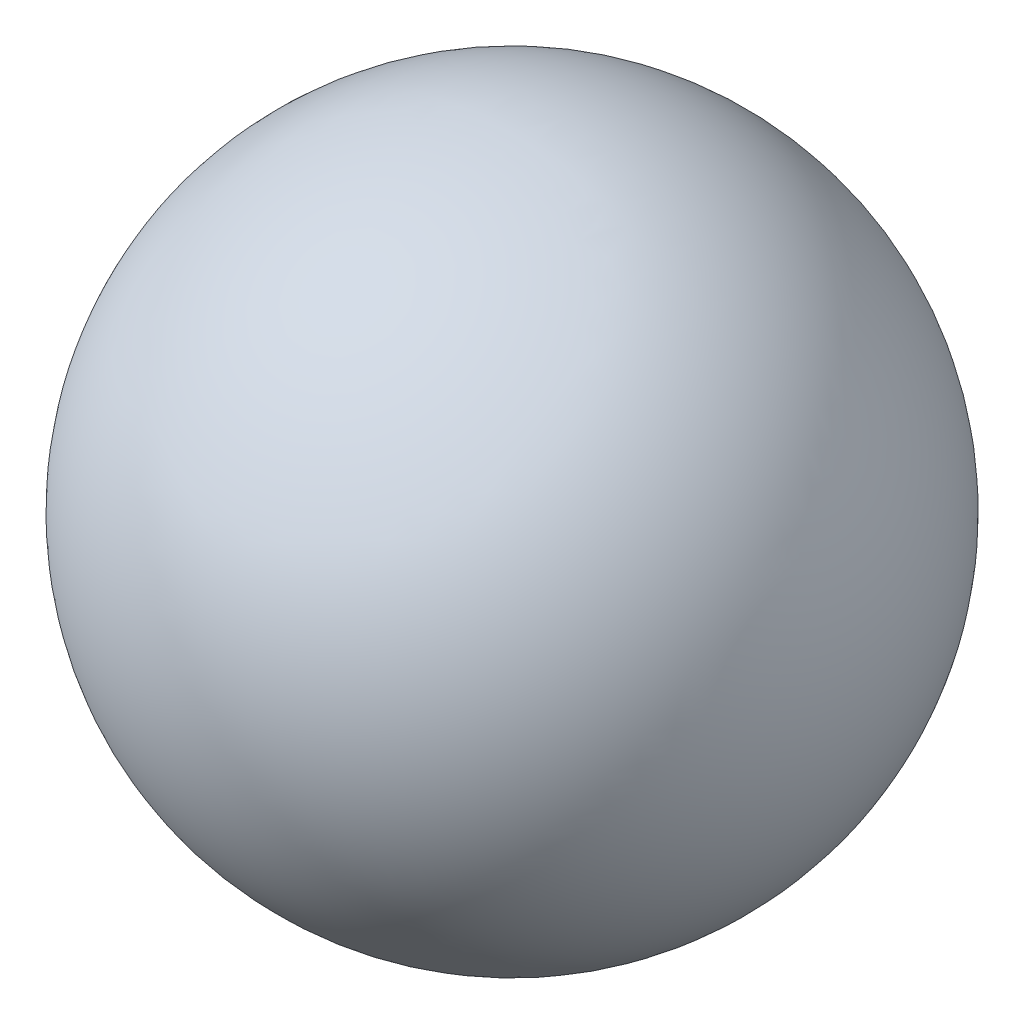
ISO-10303-21;
HEADER;
FILE_DESCRIPTION(('STEP AP214'),'2;1');
FILE_NAME('part.step','',(''),(''),'','','');
FILE_SCHEMA(('AUTOMOTIVE_DESIGN { 1 0 10303 214 1 1 1 1 }'));
ENDSEC;
DATA;
#1=APPLICATION_CONTEXT('core data for automotive mechanical design processes');
#2=APPLICATION_PROTOCOL_DEFINITION('international standard','automotive_design',2000,#1);
#3=PRODUCT_CONTEXT('',#1,'mechanical');
#4=PRODUCT('Part','Part','',(#3));
#5=PRODUCT_RELATED_PRODUCT_CATEGORY('part','',(#4));
#6=PRODUCT_DEFINITION_FORMATION('','',#4);
#7=PRODUCT_DEFINITION_CONTEXT('part definition',#1,'design');
#8=PRODUCT_DEFINITION('design','',#6,#7);
#9=PRODUCT_DEFINITION_SHAPE('','',#8);
#10=(LENGTH_UNIT() NAMED_UNIT(*) SI_UNIT(.MILLI.,.METRE.));
#11=(NAMED_UNIT(*) PLANE_ANGLE_UNIT() SI_UNIT($,.RADIAN.));
#12=(NAMED_UNIT(*) SI_UNIT($,.STERADIAN.) SOLID_ANGLE_UNIT());
#13=UNCERTAINTY_MEASURE_WITH_UNIT(LENGTH_MEASURE(1.E-05),#10,'distance_accuracy_value','');
#14=(GEOMETRIC_REPRESENTATION_CONTEXT(3) GLOBAL_UNCERTAINTY_ASSIGNED_CONTEXT((#13)) GLOBAL_UNIT_ASSIGNED_CONTEXT((#10,
#11,#12)) REPRESENTATION_CONTEXT('',''));
#15=CARTESIAN_POINT('',(0.,0.,0.));
#16=DIRECTION('',(0.,0.,1.));
#17=DIRECTION('',(1.,0.,0.));
#18=AXIS2_PLACEMENT_3D('',#15,#16,#17);
#19=CARTESIAN_POINT('',(9.81371442752061,-3.18866911070653,0.));
#20=DIRECTION('',(1.,0.,0.));
#21=DIRECTION('',(0.,1.,0.));
#22=AXIS2_PLACEMENT_3D('',#19,#20,#21);
#23=SPHERICAL_SURFACE('',#22,1.71627890103155);
#24=CARTESIAN_POINT('',(11.5299933285522,-3.18866911070653,0.));
#25=VERTEX_POINT('',#24);
#26=VERTEX_LOOP('',#25);
#27=FACE_BOUND('',#26,.T.);
#28=CARTESIAN_POINT('',(8.09743552648907,-3.18866911070653,0.));
#29=VERTEX_POINT('',#28);
#30=VERTEX_LOOP('',#29);
#31=FACE_BOUND('',#30,.T.);
#32=ADVANCED_FACE('F16',(#27,#31),#23,.T.);
#33=CLOSED_SHELL('',(#32));
#34=MANIFOLD_SOLID_BREP('B1',#33);
#35=ADVANCED_BREP_SHAPE_REPRESENTATION('',(#18,#34),#14);
#36=SHAPE_DEFINITION_REPRESENTATION(#9,#35);
ENDSEC;
END-ISO-10303-21;
